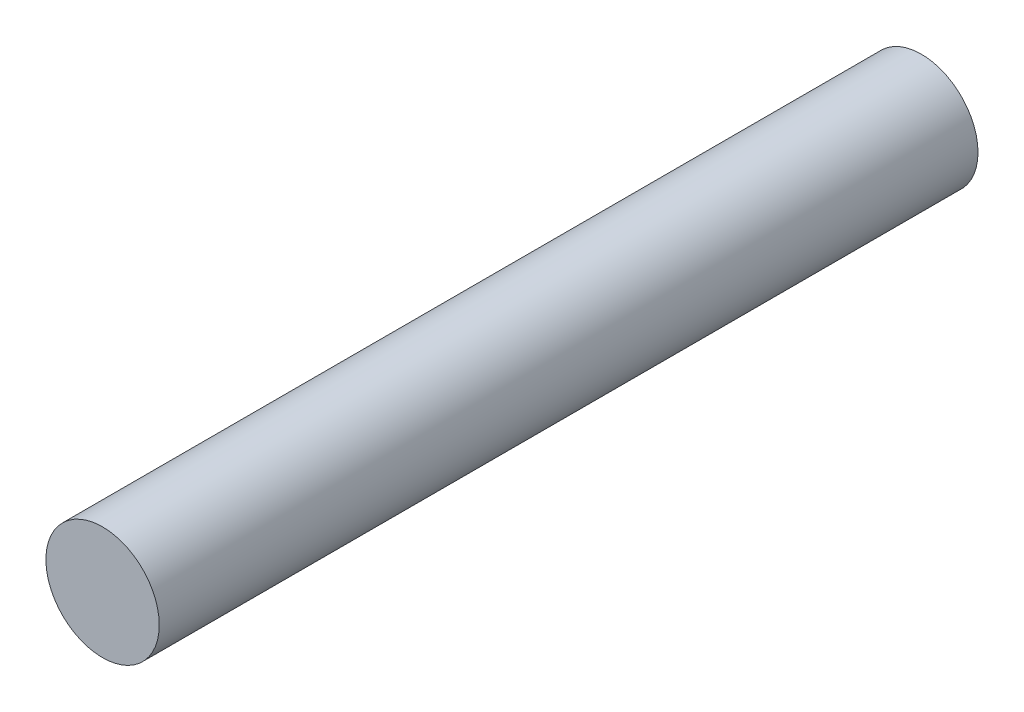
ISO-10303-21;
HEADER;
FILE_DESCRIPTION(('STEP AP214'),'2;1');
FILE_NAME('part.step','',(''),(''),'','','');
FILE_SCHEMA(('AUTOMOTIVE_DESIGN { 1 0 10303 214 1 1 1 1 }'));
ENDSEC;
DATA;
#1=APPLICATION_CONTEXT('core data for automotive mechanical design processes');
#2=APPLICATION_PROTOCOL_DEFINITION('international standard','automotive_design',2000,#1);
#3=PRODUCT_CONTEXT('',#1,'mechanical');
#4=PRODUCT('Part','Part','',(#3));
#5=PRODUCT_RELATED_PRODUCT_CATEGORY('part','',(#4));
#6=PRODUCT_DEFINITION_FORMATION('','',#4);
#7=PRODUCT_DEFINITION_CONTEXT('part definition',#1,'design');
#8=PRODUCT_DEFINITION('design','',#6,#7);
#9=PRODUCT_DEFINITION_SHAPE('','',#8);
#10=(LENGTH_UNIT() NAMED_UNIT(*) SI_UNIT(.MILLI.,.METRE.));
#11=(NAMED_UNIT(*) PLANE_ANGLE_UNIT() SI_UNIT($,.RADIAN.));
#12=(NAMED_UNIT(*) SI_UNIT($,.STERADIAN.) SOLID_ANGLE_UNIT());
#13=UNCERTAINTY_MEASURE_WITH_UNIT(LENGTH_MEASURE(1.E-05),#10,'distance_accuracy_value','');
#14=(GEOMETRIC_REPRESENTATION_CONTEXT(3) GLOBAL_UNCERTAINTY_ASSIGNED_CONTEXT((#13)) GLOBAL_UNIT_ASSIGNED_CONTEXT((#10,
#11,#12)) REPRESENTATION_CONTEXT('',''));
#15=CARTESIAN_POINT('',(0.,0.,0.));
#16=DIRECTION('',(0.,0.,1.));
#17=DIRECTION('',(1.,0.,0.));
#18=AXIS2_PLACEMENT_3D('',#15,#16,#17);
#19=CARTESIAN_POINT('',(0.,0.,66.04));
#20=DIRECTION('',(0.,0.,-1.));
#21=DIRECTION('',(-1.,0.,0.));
#22=AXIS2_PLACEMENT_3D('',#19,#20,#21);
#23=CYLINDRICAL_SURFACE('',#22,4.572);
#24=CARTESIAN_POINT('',(0.,0.,66.04));
#25=DIRECTION('',(0.,0.,1.));
#26=DIRECTION('',(1.,0.,0.));
#27=AXIS2_PLACEMENT_3D('',#24,#25,#26);
#28=CIRCLE('',#27,4.572);
#29=CARTESIAN_POINT('',(4.572,0.,66.04));
#30=VERTEX_POINT('',#29);
#31=EDGE_CURVE('E10',#30,#30,#28,.T.);
#32=ORIENTED_EDGE('',*,*,#31,.F.);
#33=EDGE_LOOP('',(#32));
#34=FACE_BOUND('',#33,.T.);
#35=CARTESIAN_POINT('',(0.,0.,0.));
#36=DIRECTION('',(0.,0.,1.));
#37=DIRECTION('',(1.,0.,0.));
#38=AXIS2_PLACEMENT_3D('',#35,#36,#37);
#39=CIRCLE('',#38,4.572);
#40=CARTESIAN_POINT('',(4.572,0.,0.));
#41=VERTEX_POINT('',#40);
#42=EDGE_CURVE('E33',#41,#41,#39,.T.);
#43=ORIENTED_EDGE('',*,*,#42,.T.);
#44=EDGE_LOOP('',(#43));
#45=FACE_BOUND('',#44,.T.);
#46=ADVANCED_FACE('F30',(#34,#45),#23,.T.);
#47=CARTESIAN_POINT('',(0.,0.,66.04));
#48=DIRECTION('',(0.,0.,1.));
#49=DIRECTION('',(1.,0.,0.));
#50=AXIS2_PLACEMENT_3D('',#47,#48,#49);
#51=PLANE('',#50);
#52=ORIENTED_EDGE('',*,*,#31,.T.);
#53=EDGE_LOOP('',(#52));
#54=FACE_BOUND('',#53,.T.);
#55=ADVANCED_FACE('F45',(#54),#51,.T.);
#56=CARTESIAN_POINT('',(0.,0.,0.));
#57=DIRECTION('',(0.,0.,1.));
#58=DIRECTION('',(1.,0.,0.));
#59=AXIS2_PLACEMENT_3D('',#56,#57,#58);
#60=PLANE('',#59);
#61=ORIENTED_EDGE('',*,*,#42,.F.);
#62=EDGE_LOOP('',(#61));
#63=FACE_BOUND('',#62,.T.);
#64=ADVANCED_FACE('F43',(#63),#60,.F.);
#65=CLOSED_SHELL('',(#46,#55,#64));
#66=MANIFOLD_SOLID_BREP('B2',#65);
#67=ADVANCED_BREP_SHAPE_REPRESENTATION('',(#18,#66),#14);
#68=SHAPE_DEFINITION_REPRESENTATION(#9,#67);
ENDSEC;
END-ISO-10303-21;
